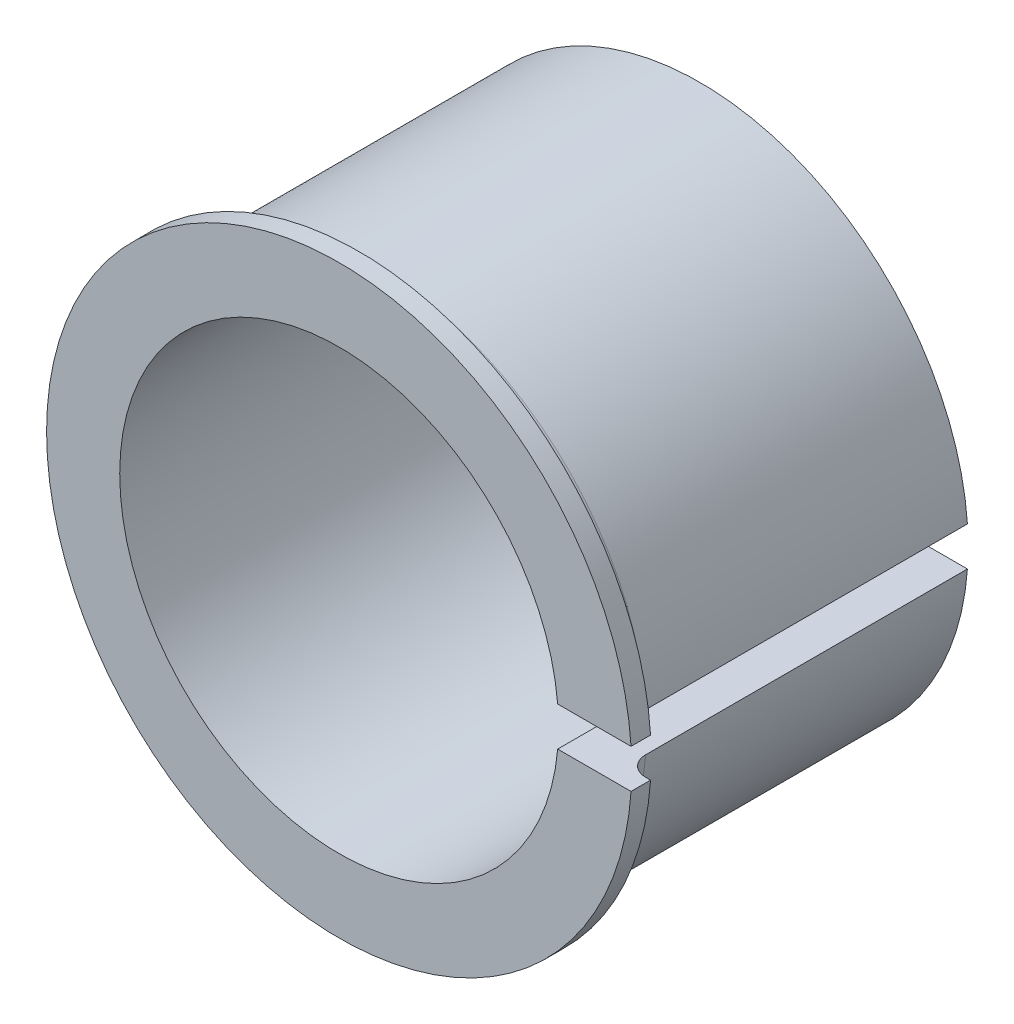
ISO-10303-21;
HEADER;
FILE_DESCRIPTION(('STEP AP214'),'2;1');
FILE_NAME('part.step','',(''),(''),'','','');
FILE_SCHEMA(('AUTOMOTIVE_DESIGN { 1 0 10303 214 1 1 1 1 }'));
ENDSEC;
DATA;
#1=APPLICATION_CONTEXT('core data for automotive mechanical design processes');
#2=APPLICATION_PROTOCOL_DEFINITION('international standard','automotive_design',2000,#1);
#3=PRODUCT_CONTEXT('',#1,'mechanical');
#4=PRODUCT('Part','Part','',(#3));
#5=PRODUCT_RELATED_PRODUCT_CATEGORY('part','',(#4));
#6=PRODUCT_DEFINITION_FORMATION('','',#4);
#7=PRODUCT_DEFINITION_CONTEXT('part definition',#1,'design');
#8=PRODUCT_DEFINITION('design','',#6,#7);
#9=PRODUCT_DEFINITION_SHAPE('','',#8);
#10=(LENGTH_UNIT() NAMED_UNIT(*) SI_UNIT(.MILLI.,.METRE.));
#11=(NAMED_UNIT(*) PLANE_ANGLE_UNIT() SI_UNIT($,.RADIAN.));
#12=(NAMED_UNIT(*) SI_UNIT($,.STERADIAN.) SOLID_ANGLE_UNIT());
#13=UNCERTAINTY_MEASURE_WITH_UNIT(LENGTH_MEASURE(1.E-05),#10,'distance_accuracy_value','');
#14=(GEOMETRIC_REPRESENTATION_CONTEXT(3) GLOBAL_UNCERTAINTY_ASSIGNED_CONTEXT((#13)) GLOBAL_UNIT_ASSIGNED_CONTEXT((#10,
#11,#12)) REPRESENTATION_CONTEXT('',''));
#15=CARTESIAN_POINT('',(0.,0.,0.));
#16=DIRECTION('',(0.,0.,1.));
#17=DIRECTION('',(1.,0.,0.));
#18=AXIS2_PLACEMENT_3D('',#15,#16,#17);
#19=CARTESIAN_POINT('',(0.,0.,35.));
#20=DIRECTION('',(0.,0.,-1.));
#21=DIRECTION('',(-1.,0.,0.));
#22=AXIS2_PLACEMENT_3D('',#19,#20,#21);
#23=CYLINDRICAL_SURFACE('',#22,27.5);
#24=DIRECTION('',(0.,0.,-1.));
#25=VECTOR('',#24,1.);
#26=CARTESIAN_POINT('',(27.427176303805,-2.,35.));
#27=LINE('',#26,#25);
#28=CARTESIAN_POINT('',(27.427176303805,-2.,33.));
#29=VERTEX_POINT('',#28);
#30=CARTESIAN_POINT('',(27.427176303805,-2.,0.));
#31=VERTEX_POINT('',#30);
#32=EDGE_CURVE('E141',#29,#31,#27,.T.);
#33=ORIENTED_EDGE('',*,*,#32,.F.);
#34=CARTESIAN_POINT('',(0.,0.,33.));
#35=DIRECTION('',(0.,0.,1.));
#36=DIRECTION('',(1.,0.,0.));
#37=AXIS2_PLACEMENT_3D('',#34,#35,#36);
#38=CIRCLE('',#37,27.5);
#39=CARTESIAN_POINT('',(27.427176303805,2.,33.));
#40=VERTEX_POINT('',#39);
#41=EDGE_CURVE('E52',#29,#40,#38,.F.);
#42=ORIENTED_EDGE('',*,*,#41,.T.);
#43=DIRECTION('',(0.,0.,-1.));
#44=VECTOR('',#43,1.);
#45=CARTESIAN_POINT('',(27.427176303805,2.,35.));
#46=LINE('',#45,#44);
#47=CARTESIAN_POINT('',(27.427176303805,2.,0.));
#48=VERTEX_POINT('',#47);
#49=EDGE_CURVE('E106',#40,#48,#46,.T.);
#50=ORIENTED_EDGE('',*,*,#49,.T.);
#51=CARTESIAN_POINT('',(0.,0.,0.));
#52=DIRECTION('',(0.,0.,1.));
#53=DIRECTION('',(1.,0.,0.));
#54=AXIS2_PLACEMENT_3D('',#51,#52,#53);
#55=CIRCLE('',#54,27.5);
#56=EDGE_CURVE('E152',#48,#31,#55,.T.);
#57=ORIENTED_EDGE('',*,*,#56,.T.);
#58=EDGE_LOOP('',(#33,#42,#50,#57));
#59=FACE_BOUND('',#58,.T.);
#60=ADVANCED_FACE('F32',(#59),#23,.T.);
#61=CARTESIAN_POINT('',(22.410934831015,-2.,35.));
#62=DIRECTION('',(0.,-1.,0.));
#63=DIRECTION('',(0.,0.,-1.));
#64=AXIS2_PLACEMENT_3D('',#61,#62,#63);
#65=PLANE('',#64);
#66=DIRECTION('',(-1.,0.,0.));
#67=VECTOR('',#66,1.);
#68=CARTESIAN_POINT('',(22.410934831015,-2.,0.));
#69=LINE('',#68,#67);
#70=CARTESIAN_POINT('',(22.410934831015,-2.,0.));
#71=VERTEX_POINT('',#70);
#72=EDGE_CURVE('E150',#31,#71,#69,.T.);
#73=ORIENTED_EDGE('',*,*,#72,.T.);
#74=DIRECTION('',(0.,0.,-1.));
#75=VECTOR('',#74,1.);
#76=CARTESIAN_POINT('',(22.410934831015,-2.,35.));
#77=LINE('',#76,#75);
#78=CARTESIAN_POINT('',(22.410934831015,-2.,37.));
#79=VERTEX_POINT('',#78);
#80=EDGE_CURVE('E105',#79,#71,#77,.T.);
#81=ORIENTED_EDGE('',*,*,#80,.F.);
#82=DIRECTION('',(-1.,0.,0.));
#83=VECTOR('',#82,1.);
#84=CARTESIAN_POINT('',(22.410934831015,-2.,37.));
#85=LINE('',#84,#83);
#86=CARTESIAN_POINT('',(29.9332590941915,-2.,37.));
#87=VERTEX_POINT('',#86);
#88=EDGE_CURVE('E120',#87,#79,#85,.T.);
#89=ORIENTED_EDGE('',*,*,#88,.F.);
#90=DIRECTION('',(0.,0.,-1.));
#91=VECTOR('',#90,1.);
#92=CARTESIAN_POINT('',(29.9332590941915,-2.,37.));
#93=LINE('',#92,#91);
#94=CARTESIAN_POINT('',(29.9332590941915,-2.,35.));
#95=VERTEX_POINT('',#94);
#96=EDGE_CURVE('E128',#87,#95,#93,.T.);
#97=ORIENTED_EDGE('',*,*,#96,.T.);
#98=DIRECTION('',(-1.,0.,0.));
#99=VECTOR('',#98,1.);
#100=CARTESIAN_POINT('',(22.410934831015,-2.,35.));
#101=LINE('',#100,#99);
#102=CARTESIAN_POINT('',(29.4321253055229,-2.,35.));
#103=VERTEX_POINT('',#102);
#104=EDGE_CURVE('E121',#95,#103,#101,.T.);
#105=ORIENTED_EDGE('',*,*,#104,.T.);
#106=CARTESIAN_POINT('',(29.4321253055229,-2.,35.));
#107=CARTESIAN_POINT('',(29.3756193258973,-2.,34.9999995567275));
#108=CARTESIAN_POINT('',(29.3191404146541,-2.,34.9976148251061));
#109=CARTESIAN_POINT('',(29.2065862170768,-2.,34.9881010812275));
#110=CARTESIAN_POINT('',(29.1505109127974,-2.,34.9809722812356));
#111=CARTESIAN_POINT('',(28.9835840062603,-2.,34.9525360524641));
#112=CARTESIAN_POINT('',(28.8738496458079,-2.,34.9241786159195));
#113=CARTESIAN_POINT('',(28.6607007911872,-2.,34.8494418305688));
#114=CARTESIAN_POINT('',(28.5572894614477,-2.,34.8030535420934));
#115=CARTESIAN_POINT('',(28.3597360282148,-2.,34.6935642155792));
#116=CARTESIAN_POINT('',(28.2655921532279,-2.,34.6304663801485));
#117=CARTESIAN_POINT('',(28.0893436272567,-2.,34.4893995420931));
#118=CARTESIAN_POINT('',(28.0072280481523,-2.,34.4114441881103));
#119=CARTESIAN_POINT('',(27.8572687177362,-2.,34.2428066564232));
#120=CARTESIAN_POINT('',(27.7894276834255,-2.,34.1521220613156));
#121=CARTESIAN_POINT('',(27.6701240945512,-2.,33.960828902893));
#122=CARTESIAN_POINT('',(27.6186275009142,-2.,33.8602415436193));
#123=CARTESIAN_POINT('',(27.5333262634409,-2.,33.6518556575135));
#124=CARTESIAN_POINT('',(27.4995106005223,-2.,33.5440616693488));
#125=CARTESIAN_POINT('',(27.4591178995875,-2.,33.3629835536173));
#126=CARTESIAN_POINT('',(27.4471470660164,-2.,33.290856962309));
#127=CARTESIAN_POINT('',(27.4311774443081,-2.,33.1458305402775));
#128=CARTESIAN_POINT('',(27.4271673562698,-2.,33.0729319534505));
#129=CARTESIAN_POINT('',(27.427176303805,-2.,33.));
#130=B_SPLINE_CURVE_WITH_KNOTS('',3,(#106,#107,#108,#109,#110,#111,#112,#113,#114,#115,#116,
#117,#118,#119,#120,#121,#122,#123,#124,#125,#126,#127,#128,#129),.UNSPECIFIED.,.F.,.F.,(4,2,2,
2,2,2,2,2,2,2,2,4),(0.,0.169413865087782,0.338820150547767,0.677094362317339,1.01553650430756,
1.35391382622801,1.69198178810968,2.0301140393786,2.36753740114908,2.7047502230452,
2.92368192488206,3.14230264070018),.UNSPECIFIED.);
#131=EDGE_CURVE('E45',#103,#29,#130,.T.);
#132=ORIENTED_EDGE('',*,*,#131,.T.);
#133=ORIENTED_EDGE('',*,*,#32,.T.);
#134=EDGE_LOOP('',(#73,#81,#89,#97,#105,#132,#133));
#135=FACE_BOUND('',#134,.T.);
#136=ADVANCED_FACE('F167',(#135),#65,.F.);
#137=CARTESIAN_POINT('',(0.,0.,35.));
#138=DIRECTION('',(0.,0.,-1.));
#139=DIRECTION('',(-1.,0.,0.));
#140=AXIS2_PLACEMENT_3D('',#137,#138,#139);
#141=CYLINDRICAL_SURFACE('',#140,22.5);
#142=CARTESIAN_POINT('',(0.,0.,0.));
#143=DIRECTION('',(0.,0.,-1.));
#144=DIRECTION('',(1.,0.,0.));
#145=AXIS2_PLACEMENT_3D('',#142,#143,#144);
#146=CIRCLE('',#145,22.5);
#147=CARTESIAN_POINT('',(22.410934831015,2.,0.));
#148=VERTEX_POINT('',#147);
#149=EDGE_CURVE('E101',#71,#148,#146,.T.);
#150=ORIENTED_EDGE('',*,*,#149,.T.);
#151=DIRECTION('',(0.,0.,-1.));
#152=VECTOR('',#151,1.);
#153=CARTESIAN_POINT('',(22.410934831015,2.,35.));
#154=LINE('',#153,#152);
#155=CARTESIAN_POINT('',(22.410934831015,2.,37.));
#156=VERTEX_POINT('',#155);
#157=EDGE_CURVE('E94',#156,#148,#154,.T.);
#158=ORIENTED_EDGE('',*,*,#157,.F.);
#159=CARTESIAN_POINT('',(0.,0.,37.));
#160=DIRECTION('',(0.,0.,-1.));
#161=DIRECTION('',(1.,0.,0.));
#162=AXIS2_PLACEMENT_3D('',#159,#160,#161);
#163=CIRCLE('',#162,22.5);
#164=EDGE_CURVE('E99',#79,#156,#163,.T.);
#165=ORIENTED_EDGE('',*,*,#164,.F.);
#166=ORIENTED_EDGE('',*,*,#80,.T.);
#167=EDGE_LOOP('',(#150,#158,#165,#166));
#168=FACE_BOUND('',#167,.T.);
#169=ADVANCED_FACE('F96',(#168),#141,.F.);
#170=CARTESIAN_POINT('',(22.410934831015,2.,35.));
#171=DIRECTION('',(0.,1.,0.));
#172=DIRECTION('',(0.,0.,1.));
#173=AXIS2_PLACEMENT_3D('',#170,#171,#172);
#174=PLANE('',#173);
#175=DIRECTION('',(1.,0.,0.));
#176=VECTOR('',#175,1.);
#177=CARTESIAN_POINT('',(22.410934831015,2.,0.));
#178=LINE('',#177,#176);
#179=EDGE_CURVE('E147',#148,#48,#178,.T.);
#180=ORIENTED_EDGE('',*,*,#179,.T.);
#181=ORIENTED_EDGE('',*,*,#49,.F.);
#182=CARTESIAN_POINT('',(27.427176303805,2.,33.));
#183=CARTESIAN_POINT('',(27.4271765926507,2.,33.0561635173988));
#184=CARTESIAN_POINT('',(27.4295498359029,2.,33.1123000879819));
#185=CARTESIAN_POINT('',(27.4390170949052,2.,33.2241706430701));
#186=CARTESIAN_POINT('',(27.4461108576465,2.,33.27990464899));
#187=CARTESIAN_POINT('',(27.4744030037403,2.,33.4457977113935));
#188=CARTESIAN_POINT('',(27.5026124466626,2.,33.5548441334436));
#189=CARTESIAN_POINT('',(27.5769322759047,2.,33.766647940289));
#190=CARTESIAN_POINT('',(27.6230507620721,2.,33.8694024550205));
#191=CARTESIAN_POINT('',(27.7318594287062,2.,34.0657221619571));
#192=CARTESIAN_POINT('',(27.7945470654312,2.,34.1592887616946));
#193=CARTESIAN_POINT('',(27.9347879456988,2.,34.3347049349963));
#194=CARTESIAN_POINT('',(28.0123590935101,2.,34.416540186934));
#195=CARTESIAN_POINT('',(28.1801271083806,2.,34.5660824555157));
#196=CARTESIAN_POINT('',(28.270326514699,2.,34.6337866238795));
#197=CARTESIAN_POINT('',(28.4610225616637,2.,34.7533100230613));
#198=CARTESIAN_POINT('',(28.5615459311048,2.,34.8050865600039));
#199=CARTESIAN_POINT('',(28.7698270572516,2.,34.8910430079449));
#200=CARTESIAN_POINT('',(28.8775807676498,2.,34.9252326697405));
#201=CARTESIAN_POINT('',(29.0603265281116,2.,34.966721060568));
#202=CARTESIAN_POINT('',(29.134186036301,2.,34.9791928299877));
#203=CARTESIAN_POINT('',(29.2827286394526,2.,34.99583136377));
#204=CARTESIAN_POINT('',(29.3574104224333,2.,35.0000098445156));
#205=CARTESIAN_POINT('',(29.4321253055229,2.,35.));
#206=B_SPLINE_CURVE_WITH_KNOTS('',3,(#182,#183,#184,#185,#186,#187,#188,#189,#190,#191,#192,
#193,#194,#195,#196,#197,#198,#199,#200,#201,#202,#203,#204,#205),.UNSPECIFIED.,.F.,.F.,(4,2,2,
2,2,2,2,2,2,2,2,4),(0.,0.16838692380232,0.336764823184909,0.672939165201528,1.0092657285441,
1.34554068806727,1.6822227383349,2.01897258529428,2.35661737619897,2.69407476234518,
2.91835536825512,3.14231889449372),.UNSPECIFIED.);
#207=CARTESIAN_POINT('',(29.4321253055229,2.,35.));
#208=VERTEX_POINT('',#207);
#209=EDGE_CURVE('E11',#40,#208,#206,.T.);
#210=ORIENTED_EDGE('',*,*,#209,.T.);
#211=DIRECTION('',(1.,0.,0.));
#212=VECTOR('',#211,1.);
#213=CARTESIAN_POINT('',(22.410934831015,2.,35.));
#214=LINE('',#213,#212);
#215=CARTESIAN_POINT('',(29.9332590941915,2.,35.));
#216=VERTEX_POINT('',#215);
#217=EDGE_CURVE('E133',#208,#216,#214,.T.);
#218=ORIENTED_EDGE('',*,*,#217,.T.);
#219=DIRECTION('',(0.,0.,-1.));
#220=VECTOR('',#219,1.);
#221=CARTESIAN_POINT('',(29.9332590941915,2.,37.));
#222=LINE('',#221,#220);
#223=CARTESIAN_POINT('',(29.9332590941915,2.,37.));
#224=VERTEX_POINT('',#223);
#225=EDGE_CURVE('E112',#224,#216,#222,.T.);
#226=ORIENTED_EDGE('',*,*,#225,.F.);
#227=DIRECTION('',(1.,0.,0.));
#228=VECTOR('',#227,1.);
#229=CARTESIAN_POINT('',(22.410934831015,2.,37.));
#230=LINE('',#229,#228);
#231=EDGE_CURVE('E109',#156,#224,#230,.T.);
#232=ORIENTED_EDGE('',*,*,#231,.F.);
#233=ORIENTED_EDGE('',*,*,#157,.T.);
#234=EDGE_LOOP('',(#180,#181,#210,#218,#226,#232,#233));
#235=FACE_BOUND('',#234,.T.);
#236=ADVANCED_FACE('F110',(#235),#174,.F.);
#237=CARTESIAN_POINT('',(0.,0.,0.));
#238=DIRECTION('',(0.,0.,1.));
#239=DIRECTION('',(1.,0.,0.));
#240=AXIS2_PLACEMENT_3D('',#237,#238,#239);
#241=PLANE('',#240);
#242=ORIENTED_EDGE('',*,*,#56,.F.);
#243=ORIENTED_EDGE('',*,*,#179,.F.);
#244=ORIENTED_EDGE('',*,*,#149,.F.);
#245=ORIENTED_EDGE('',*,*,#72,.F.);
#246=EDGE_LOOP('',(#242,#243,#244,#245));
#247=FACE_BOUND('',#246,.T.);
#248=ADVANCED_FACE('F183',(#247),#241,.F.);
#249=CARTESIAN_POINT('',(0.,0.,35.));
#250=DIRECTION('',(0.,0.,1.));
#251=DIRECTION('',(1.,0.,0.));
#252=AXIS2_PLACEMENT_3D('',#249,#250,#251);
#253=PLANE('',#252);
#254=ORIENTED_EDGE('',*,*,#217,.F.);
#255=CARTESIAN_POINT('',(0.,0.,35.));
#256=DIRECTION('',(0.,0.,1.));
#257=DIRECTION('',(1.,0.,0.));
#258=AXIS2_PLACEMENT_3D('',#255,#256,#257);
#259=CIRCLE('',#258,29.5);
#260=EDGE_CURVE('E138',#208,#103,#259,.T.);
#261=ORIENTED_EDGE('',*,*,#260,.T.);
#262=ORIENTED_EDGE('',*,*,#104,.F.);
#263=CARTESIAN_POINT('',(0.,0.,35.));
#264=DIRECTION('',(0.,0.,1.));
#265=DIRECTION('',(1.,0.,0.));
#266=AXIS2_PLACEMENT_3D('',#263,#264,#265);
#267=CIRCLE('',#266,30.);
#268=EDGE_CURVE('E123',#216,#95,#267,.T.);
#269=ORIENTED_EDGE('',*,*,#268,.F.);
#270=EDGE_LOOP('',(#254,#261,#262,#269));
#271=FACE_BOUND('',#270,.T.);
#272=ADVANCED_FACE('F165',(#271),#253,.F.);
#273=CARTESIAN_POINT('',(0.,0.,37.));
#274=DIRECTION('',(0.,0.,-1.));
#275=DIRECTION('',(-1.,0.,0.));
#276=AXIS2_PLACEMENT_3D('',#273,#274,#275);
#277=CYLINDRICAL_SURFACE('',#276,30.);
#278=ORIENTED_EDGE('',*,*,#268,.T.);
#279=ORIENTED_EDGE('',*,*,#96,.F.);
#280=CARTESIAN_POINT('',(0.,0.,37.));
#281=DIRECTION('',(0.,0.,1.));
#282=DIRECTION('',(1.,0.,0.));
#283=AXIS2_PLACEMENT_3D('',#280,#281,#282);
#284=CIRCLE('',#283,30.);
#285=EDGE_CURVE('E115',#224,#87,#284,.T.);
#286=ORIENTED_EDGE('',*,*,#285,.F.);
#287=ORIENTED_EDGE('',*,*,#225,.T.);
#288=EDGE_LOOP('',(#278,#279,#286,#287));
#289=FACE_BOUND('',#288,.T.);
#290=ADVANCED_FACE('F162',(#289),#277,.T.);
#291=CARTESIAN_POINT('',(0.,0.,37.));
#292=DIRECTION('',(0.,0.,1.));
#293=DIRECTION('',(1.,0.,0.));
#294=AXIS2_PLACEMENT_3D('',#291,#292,#293);
#295=PLANE('',#294);
#296=ORIENTED_EDGE('',*,*,#164,.T.);
#297=ORIENTED_EDGE('',*,*,#231,.T.);
#298=ORIENTED_EDGE('',*,*,#285,.T.);
#299=ORIENTED_EDGE('',*,*,#88,.T.);
#300=EDGE_LOOP('',(#296,#297,#298,#299));
#301=FACE_BOUND('',#300,.T.);
#302=ADVANCED_FACE('F118',(#301),#295,.T.);
#303=CARTESIAN_POINT('',(0.,0.,33.));
#304=DIRECTION('',(0.,0.,1.));
#305=DIRECTION('',(1.,0.,0.));
#306=AXIS2_PLACEMENT_3D('',#303,#304,#305);
#307=TOROIDAL_SURFACE('',#306,29.5,2.);
#308=ORIENTED_EDGE('',*,*,#209,.F.);
#309=ORIENTED_EDGE('',*,*,#41,.F.);
#310=ORIENTED_EDGE('',*,*,#131,.F.);
#311=ORIENTED_EDGE('',*,*,#260,.F.);
#312=EDGE_LOOP('',(#308,#309,#310,#311));
#313=FACE_BOUND('',#312,.T.);
#314=ADVANCED_FACE('F34',(#313),#307,.F.);
#315=CLOSED_SHELL('',(#60,#136,#169,#236,#248,#272,#290,#302,#314));
#316=MANIFOLD_SOLID_BREP('B2',#315);
#317=ADVANCED_BREP_SHAPE_REPRESENTATION('',(#18,#316),#14);
#318=SHAPE_DEFINITION_REPRESENTATION(#9,#317);
ENDSEC;
END-ISO-10303-21;
